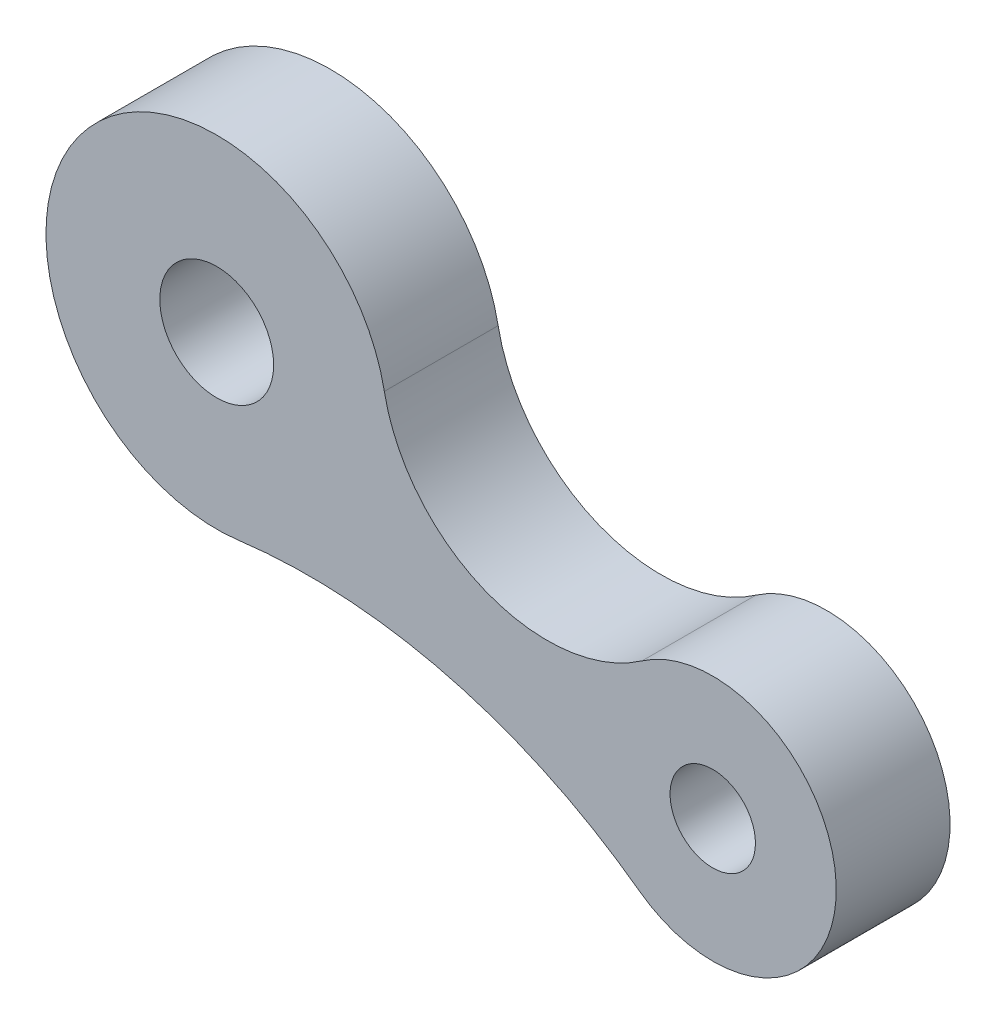
ISO-10303-21;
HEADER;
FILE_DESCRIPTION(('STEP AP214'),'2;1');
FILE_NAME('part.step','',(''),(''),'','','');
FILE_SCHEMA(('AUTOMOTIVE_DESIGN { 1 0 10303 214 1 1 1 1 }'));
ENDSEC;
DATA;
#1=APPLICATION_CONTEXT('core data for automotive mechanical design processes');
#2=APPLICATION_PROTOCOL_DEFINITION('international standard','automotive_design',2000,#1);
#3=PRODUCT_CONTEXT('',#1,'mechanical');
#4=PRODUCT('Part','Part','',(#3));
#5=PRODUCT_RELATED_PRODUCT_CATEGORY('part','',(#4));
#6=PRODUCT_DEFINITION_FORMATION('','',#4);
#7=PRODUCT_DEFINITION_CONTEXT('part definition',#1,'design');
#8=PRODUCT_DEFINITION('design','',#6,#7);
#9=PRODUCT_DEFINITION_SHAPE('','',#8);
#10=(LENGTH_UNIT() NAMED_UNIT(*) SI_UNIT(.MILLI.,.METRE.));
#11=(NAMED_UNIT(*) PLANE_ANGLE_UNIT() SI_UNIT($,.RADIAN.));
#12=(NAMED_UNIT(*) SI_UNIT($,.STERADIAN.) SOLID_ANGLE_UNIT());
#13=UNCERTAINTY_MEASURE_WITH_UNIT(LENGTH_MEASURE(1.E-05),#10,'distance_accuracy_value','');
#14=(GEOMETRIC_REPRESENTATION_CONTEXT(3) GLOBAL_UNCERTAINTY_ASSIGNED_CONTEXT((#13)) GLOBAL_UNIT_ASSIGNED_CONTEXT((#10,
#11,#12)) REPRESENTATION_CONTEXT('',''));
#15=CARTESIAN_POINT('',(0.,0.,0.));
#16=DIRECTION('',(0.,0.,1.));
#17=DIRECTION('',(1.,0.,0.));
#18=AXIS2_PLACEMENT_3D('',#15,#16,#17);
#19=CARTESIAN_POINT('',(113.750122427647,-19.1883451085088,40.));
#20=DIRECTION('',(0.,0.,1.));
#21=DIRECTION('',(1.,0.,0.));
#22=AXIS2_PLACEMENT_3D('',#19,#20,#21);
#23=PLANE('',#22);
#24=CARTESIAN_POINT('',(-31.4728807786569,0.,40.));
#25=DIRECTION('',(0.,0.,1.));
#26=DIRECTION('',(1.,0.,0.));
#27=AXIS2_PLACEMENT_3D('',#24,#25,#26);
#28=CIRCLE('',#27,20.);
#29=CARTESIAN_POINT('',(-11.4728807786569,0.,40.));
#30=VERTEX_POINT('',#29);
#31=EDGE_CURVE('E102',#30,#30,#28,.T.);
#32=ORIENTED_EDGE('',*,*,#31,.F.);
#33=EDGE_LOOP('',(#32));
#34=FACE_BOUND('',#33,.T.);
#35=CARTESIAN_POINT('',(84.6635912055492,22.5213204555533,40.));
#36=DIRECTION('',(0.,0.,-1.));
#37=DIRECTION('',(1.,0.,0.));
#38=AXIS2_PLACEMENT_3D('',#35,#36,#37);
#39=CIRCLE('',#38,58.3);
#40=CARTESIAN_POINT('',(118.011570954779,-25.2992007319554,40.));
#41=VERTEX_POINT('',#40);
#42=CARTESIAN_POINT('',(27.4298099994696,11.4224786756821,40.));
#43=VERTEX_POINT('',#42);
#44=EDGE_CURVE('E87',#41,#43,#39,.T.);
#45=ORIENTED_EDGE('',*,*,#44,.T.);
#46=CARTESIAN_POINT('',(-31.4728807786569,0.,40.));
#47=DIRECTION('',(0.,0.,1.));
#48=DIRECTION('',(1.,0.,0.));
#49=AXIS2_PLACEMENT_3D('',#46,#47,#48);
#50=CIRCLE('',#49,60.);
#51=CARTESIAN_POINT('',(-23.8331670547935,-59.5116356204181,40.));
#52=VERTEX_POINT('',#51);
#53=EDGE_CURVE('E82',#43,#52,#50,.T.);
#54=ORIENTED_EDGE('',*,*,#53,.T.);
#55=CARTESIAN_POINT('',(1.14869682224005,-254.114684099185,40.));
#56=DIRECTION('',(0.,0.,-1.));
#57=DIRECTION('',(1.,0.,0.));
#58=AXIS2_PLACEMENT_3D('',#55,#56,#57);
#59=CIRCLE('',#58,196.2);
#60=CARTESIAN_POINT('',(117.171973656783,-95.8963563600294,40.));
#61=VERTEX_POINT('',#60);
#62=EDGE_CURVE('E85',#52,#61,#59,.T.);
#63=ORIENTED_EDGE('',*,*,#62,.T.);
#64=CARTESIAN_POINT('',(142.836653649746,-60.8980106725709,40.));
#65=DIRECTION('',(0.,0.,1.));
#66=DIRECTION('',(1.,0.,0.));
#67=AXIS2_PLACEMENT_3D('',#64,#65,#66);
#68=CIRCLE('',#67,43.4);
#69=EDGE_CURVE('E52',#61,#41,#68,.T.);
#70=ORIENTED_EDGE('',*,*,#69,.T.);
#71=EDGE_LOOP('',(#45,#54,#63,#70));
#72=FACE_BOUND('',#71,.T.);
#73=CARTESIAN_POINT('',(142.836653649746,-60.8980106725709,40.));
#74=DIRECTION('',(0.,0.,1.));
#75=DIRECTION('',(1.,0.,0.));
#76=AXIS2_PLACEMENT_3D('',#73,#74,#75);
#77=CIRCLE('',#76,15.);
#78=CARTESIAN_POINT('',(157.836653649746,-60.8980106725709,40.));
#79=VERTEX_POINT('',#78);
#80=EDGE_CURVE('E117',#79,#79,#77,.T.);
#81=ORIENTED_EDGE('',*,*,#80,.F.);
#82=EDGE_LOOP('',(#81));
#83=FACE_BOUND('',#82,.T.);
#84=ADVANCED_FACE('F35',(#34,#72,#83),#23,.T.);
#85=CARTESIAN_POINT('',(113.750122427647,-19.1883451085088,0.));
#86=DIRECTION('',(0.,0.,1.));
#87=DIRECTION('',(1.,0.,0.));
#88=AXIS2_PLACEMENT_3D('',#85,#86,#87);
#89=PLANE('',#88);
#90=CARTESIAN_POINT('',(84.6635912055492,22.5213204555533,0.));
#91=DIRECTION('',(0.,0.,-1.));
#92=DIRECTION('',(1.,0.,0.));
#93=AXIS2_PLACEMENT_3D('',#90,#91,#92);
#94=CIRCLE('',#93,58.3);
#95=CARTESIAN_POINT('',(118.011570954779,-25.2992007319554,0.));
#96=VERTEX_POINT('',#95);
#97=CARTESIAN_POINT('',(27.4298099994696,11.4224786756821,0.));
#98=VERTEX_POINT('',#97);
#99=EDGE_CURVE('E99',#96,#98,#94,.T.);
#100=ORIENTED_EDGE('',*,*,#99,.F.);
#101=CARTESIAN_POINT('',(142.836653649746,-60.8980106725709,0.));
#102=DIRECTION('',(0.,0.,1.));
#103=DIRECTION('',(1.,0.,0.));
#104=AXIS2_PLACEMENT_3D('',#101,#102,#103);
#105=CIRCLE('',#104,43.4);
#106=CARTESIAN_POINT('',(117.171973656783,-95.8963563600294,0.));
#107=VERTEX_POINT('',#106);
#108=EDGE_CURVE('E75',#107,#96,#105,.T.);
#109=ORIENTED_EDGE('',*,*,#108,.F.);
#110=CARTESIAN_POINT('',(1.14869682224005,-254.114684099185,0.));
#111=DIRECTION('',(0.,0.,-1.));
#112=DIRECTION('',(1.,0.,0.));
#113=AXIS2_PLACEMENT_3D('',#110,#111,#112);
#114=CIRCLE('',#113,196.2);
#115=CARTESIAN_POINT('',(-23.8331670547935,-59.5116356204181,0.));
#116=VERTEX_POINT('',#115);
#117=EDGE_CURVE('E69',#116,#107,#114,.T.);
#118=ORIENTED_EDGE('',*,*,#117,.F.);
#119=CARTESIAN_POINT('',(-31.4728807786569,0.,0.));
#120=DIRECTION('',(0.,0.,1.));
#121=DIRECTION('',(1.,0.,0.));
#122=AXIS2_PLACEMENT_3D('',#119,#120,#121);
#123=CIRCLE('',#122,60.);
#124=EDGE_CURVE('E91',#98,#116,#123,.T.);
#125=ORIENTED_EDGE('',*,*,#124,.F.);
#126=EDGE_LOOP('',(#100,#109,#118,#125));
#127=FACE_BOUND('',#126,.T.);
#128=CARTESIAN_POINT('',(-31.4728807786569,0.,0.));
#129=DIRECTION('',(0.,0.,1.));
#130=DIRECTION('',(1.,0.,0.));
#131=AXIS2_PLACEMENT_3D('',#128,#129,#130);
#132=CIRCLE('',#131,20.);
#133=CARTESIAN_POINT('',(-11.4728807786569,0.,0.));
#134=VERTEX_POINT('',#133);
#135=EDGE_CURVE('E114',#134,#134,#132,.T.);
#136=ORIENTED_EDGE('',*,*,#135,.T.);
#137=EDGE_LOOP('',(#136));
#138=FACE_BOUND('',#137,.T.);
#139=CARTESIAN_POINT('',(142.836653649746,-60.8980106725709,0.));
#140=DIRECTION('',(0.,0.,1.));
#141=DIRECTION('',(1.,0.,0.));
#142=AXIS2_PLACEMENT_3D('',#139,#140,#141);
#143=CIRCLE('',#142,15.);
#144=CARTESIAN_POINT('',(157.836653649746,-60.8980106725709,0.));
#145=VERTEX_POINT('',#144);
#146=EDGE_CURVE('E120',#145,#145,#143,.T.);
#147=ORIENTED_EDGE('',*,*,#146,.T.);
#148=EDGE_LOOP('',(#147));
#149=FACE_BOUND('',#148,.T.);
#150=ADVANCED_FACE('F110',(#127,#138,#149),#89,.F.);
#151=CARTESIAN_POINT('',(84.6635912055492,22.5213204555533,40.));
#152=DIRECTION('',(0.,0.,-1.));
#153=DIRECTION('',(-1.,0.,0.));
#154=AXIS2_PLACEMENT_3D('',#151,#152,#153);
#155=CYLINDRICAL_SURFACE('',#154,58.3);
#156=ORIENTED_EDGE('',*,*,#99,.T.);
#157=DIRECTION('',(0.,0.,-1.));
#158=VECTOR('',#157,1.);
#159=CARTESIAN_POINT('',(27.4298099994696,11.4224786756821,40.));
#160=LINE('',#159,#158);
#161=EDGE_CURVE('E11',#43,#98,#160,.T.);
#162=ORIENTED_EDGE('',*,*,#161,.F.);
#163=ORIENTED_EDGE('',*,*,#44,.F.);
#164=DIRECTION('',(0.,0.,-1.));
#165=VECTOR('',#164,1.);
#166=CARTESIAN_POINT('',(118.011570954779,-25.2992007319554,40.));
#167=LINE('',#166,#165);
#168=EDGE_CURVE('E95',#41,#96,#167,.T.);
#169=ORIENTED_EDGE('',*,*,#168,.T.);
#170=EDGE_LOOP('',(#156,#162,#163,#169));
#171=FACE_BOUND('',#170,.T.);
#172=ADVANCED_FACE('F37',(#171),#155,.F.);
#173=CARTESIAN_POINT('',(-31.4728807786569,0.,40.));
#174=DIRECTION('',(0.,0.,-1.));
#175=DIRECTION('',(-1.,0.,0.));
#176=AXIS2_PLACEMENT_3D('',#173,#174,#175);
#177=CYLINDRICAL_SURFACE('',#176,60.);
#178=ORIENTED_EDGE('',*,*,#124,.T.);
#179=DIRECTION('',(0.,0.,-1.));
#180=VECTOR('',#179,1.);
#181=CARTESIAN_POINT('',(-23.8331670547935,-59.5116356204181,40.));
#182=LINE('',#181,#180);
#183=EDGE_CURVE('E44',#52,#116,#182,.T.);
#184=ORIENTED_EDGE('',*,*,#183,.F.);
#185=ORIENTED_EDGE('',*,*,#53,.F.);
#186=ORIENTED_EDGE('',*,*,#161,.T.);
#187=EDGE_LOOP('',(#178,#184,#185,#186));
#188=FACE_BOUND('',#187,.T.);
#189=ADVANCED_FACE('F90',(#188),#177,.T.);
#190=CARTESIAN_POINT('',(1.14869682224005,-254.114684099185,40.));
#191=DIRECTION('',(0.,0.,-1.));
#192=DIRECTION('',(-1.,0.,0.));
#193=AXIS2_PLACEMENT_3D('',#190,#191,#192);
#194=CYLINDRICAL_SURFACE('',#193,196.2);
#195=ORIENTED_EDGE('',*,*,#117,.T.);
#196=DIRECTION('',(0.,0.,-1.));
#197=VECTOR('',#196,1.);
#198=CARTESIAN_POINT('',(117.171973656783,-95.8963563600294,40.));
#199=LINE('',#198,#197);
#200=EDGE_CURVE('E92',#61,#107,#199,.T.);
#201=ORIENTED_EDGE('',*,*,#200,.F.);
#202=ORIENTED_EDGE('',*,*,#62,.F.);
#203=ORIENTED_EDGE('',*,*,#183,.T.);
#204=EDGE_LOOP('',(#195,#201,#202,#203));
#205=FACE_BOUND('',#204,.T.);
#206=ADVANCED_FACE('F93',(#205),#194,.F.);
#207=CARTESIAN_POINT('',(142.836653649746,-60.8980106725709,40.));
#208=DIRECTION('',(0.,0.,-1.));
#209=DIRECTION('',(-1.,0.,0.));
#210=AXIS2_PLACEMENT_3D('',#207,#208,#209);
#211=CYLINDRICAL_SURFACE('',#210,43.4);
#212=ORIENTED_EDGE('',*,*,#108,.T.);
#213=ORIENTED_EDGE('',*,*,#168,.F.);
#214=ORIENTED_EDGE('',*,*,#69,.F.);
#215=ORIENTED_EDGE('',*,*,#200,.T.);
#216=EDGE_LOOP('',(#212,#213,#214,#215));
#217=FACE_BOUND('',#216,.T.);
#218=ADVANCED_FACE('F107',(#217),#211,.T.);
#219=CARTESIAN_POINT('',(-31.4728807786569,0.,40.));
#220=DIRECTION('',(0.,0.,-1.));
#221=DIRECTION('',(-1.,0.,0.));
#222=AXIS2_PLACEMENT_3D('',#219,#220,#221);
#223=CYLINDRICAL_SURFACE('',#222,20.);
#224=ORIENTED_EDGE('',*,*,#31,.T.);
#225=EDGE_LOOP('',(#224));
#226=FACE_BOUND('',#225,.T.);
#227=ORIENTED_EDGE('',*,*,#135,.F.);
#228=EDGE_LOOP('',(#227));
#229=FACE_BOUND('',#228,.T.);
#230=ADVANCED_FACE('F137',(#226,#229),#223,.F.);
#231=CARTESIAN_POINT('',(142.836653649746,-60.8980106725709,40.));
#232=DIRECTION('',(0.,0.,-1.));
#233=DIRECTION('',(-1.,0.,0.));
#234=AXIS2_PLACEMENT_3D('',#231,#232,#233);
#235=CYLINDRICAL_SURFACE('',#234,15.);
#236=ORIENTED_EDGE('',*,*,#80,.T.);
#237=EDGE_LOOP('',(#236));
#238=FACE_BOUND('',#237,.T.);
#239=ORIENTED_EDGE('',*,*,#146,.F.);
#240=EDGE_LOOP('',(#239));
#241=FACE_BOUND('',#240,.T.);
#242=ADVANCED_FACE('F126',(#238,#241),#235,.F.);
#243=CLOSED_SHELL('',(#84,#150,#172,#189,#206,#218,#230,#242));
#244=MANIFOLD_SOLID_BREP('B2',#243);
#245=ADVANCED_BREP_SHAPE_REPRESENTATION('',(#18,#244),#14);
#246=SHAPE_DEFINITION_REPRESENTATION(#9,#245);
ENDSEC;
END-ISO-10303-21;
